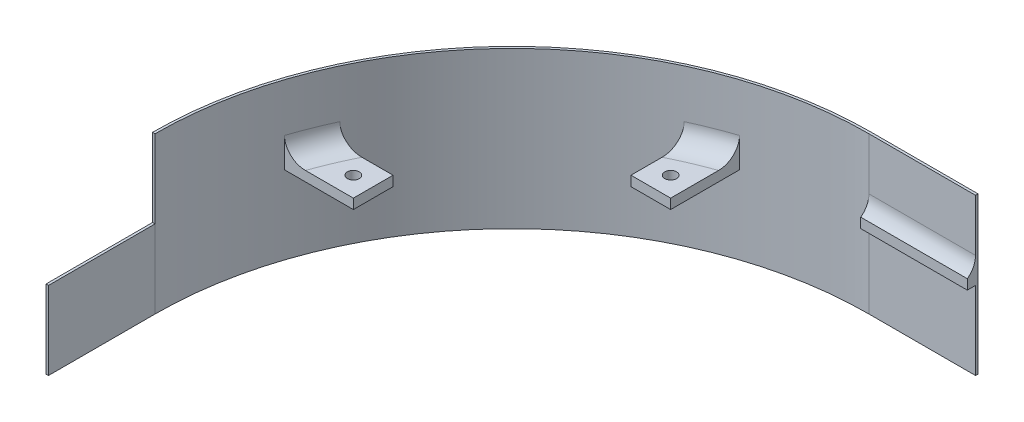
ISO-10303-21;
HEADER;
FILE_DESCRIPTION(('STEP AP214'),'2;1');
FILE_NAME('part.step','',(''),(''),'','','');
FILE_SCHEMA(('AUTOMOTIVE_DESIGN { 1 0 10303 214 1 1 1 1 }'));
ENDSEC;
DATA;
#1=APPLICATION_CONTEXT('core data for automotive mechanical design processes');
#2=APPLICATION_PROTOCOL_DEFINITION('international standard','automotive_design',2000,#1);
#3=PRODUCT_CONTEXT('',#1,'mechanical');
#4=PRODUCT('Part','Part','',(#3));
#5=PRODUCT_RELATED_PRODUCT_CATEGORY('part','',(#4));
#6=PRODUCT_DEFINITION_FORMATION('','',#4);
#7=PRODUCT_DEFINITION_CONTEXT('part definition',#1,'design');
#8=PRODUCT_DEFINITION('design','',#6,#7);
#9=PRODUCT_DEFINITION_SHAPE('','',#8);
#10=(LENGTH_UNIT() NAMED_UNIT(*) SI_UNIT(.MILLI.,.METRE.));
#11=(NAMED_UNIT(*) PLANE_ANGLE_UNIT() SI_UNIT($,.RADIAN.));
#12=(NAMED_UNIT(*) SI_UNIT($,.STERADIAN.) SOLID_ANGLE_UNIT());
#13=UNCERTAINTY_MEASURE_WITH_UNIT(LENGTH_MEASURE(1.E-05),#10,'distance_accuracy_value','');
#14=(GEOMETRIC_REPRESENTATION_CONTEXT(3) GLOBAL_UNCERTAINTY_ASSIGNED_CONTEXT((#13)) GLOBAL_UNIT_ASSIGNED_CONTEXT((#10,
#11,#12)) REPRESENTATION_CONTEXT('',''));
#15=CARTESIAN_POINT('',(0.,0.,0.));
#16=DIRECTION('',(0.,0.,1.));
#17=DIRECTION('',(1.,0.,0.));
#18=AXIS2_PLACEMENT_3D('',#15,#16,#17);
#19=CARTESIAN_POINT('',(-34.1312500000015,9.525,-3.60645655631519E-13));
#20=DIRECTION('',(1.,0.,0.));
#21=DIRECTION('',(0.,0.,-1.));
#22=AXIS2_PLACEMENT_3D('',#19,#20,#21);
#23=PLANE('',#22);
#24=DIRECTION('',(0.,-1.,0.));
#25=VECTOR('',#24,1.);
#26=CARTESIAN_POINT('',(-34.13125,31.35,-148.43125));
#27=LINE('',#26,#25);
#28=CARTESIAN_POINT('',(-34.13125,14.6689327311382,-148.43125));
#29=VERTEX_POINT('',#28);
#30=CARTESIAN_POINT('',(-34.13125,6.35,-148.43125));
#31=VERTEX_POINT('',#30);
#32=EDGE_CURVE('E58',#29,#31,#27,.T.);
#33=ORIENTED_EDGE('',*,*,#32,.T.);
#34=DIRECTION('',(0.,0.,1.));
#35=VECTOR('',#34,1.);
#36=CARTESIAN_POINT('',(-34.1312500000015,6.35,-3.60645655631519E-13));
#37=LINE('',#36,#35);
#38=CARTESIAN_POINT('',(-34.13125,6.35,-145.804481937115));
#39=VERTEX_POINT('',#38);
#40=EDGE_CURVE('E315',#31,#39,#37,.T.);
#41=ORIENTED_EDGE('',*,*,#40,.T.);
#42=DIRECTION('',(0.,-1.,0.));
#43=VECTOR('',#42,1.);
#44=CARTESIAN_POINT('',(-34.13125,9.525,-145.804481937115));
#45=LINE('',#44,#43);
#46=CARTESIAN_POINT('',(-34.13125,9.525,-145.804481937115));
#47=VERTEX_POINT('',#46);
#48=EDGE_CURVE('E306',#47,#39,#45,.T.);
#49=ORIENTED_EDGE('',*,*,#48,.F.);
#50=CARTESIAN_POINT('',(-34.13125,14.6689327311382,-142.081250000004));
#51=DIRECTION('',(1.,0.,0.));
#52=DIRECTION('',(0.,0.,-1.));
#53=AXIS2_PLACEMENT_3D('',#50,#51,#52);
#54=CIRCLE('',#53,6.35);
#55=EDGE_CURVE('E51',#47,#29,#54,.T.);
#56=ORIENTED_EDGE('',*,*,#55,.T.);
#57=EDGE_LOOP('',(#33,#41,#49,#56));
#58=FACE_BOUND('',#57,.T.);
#59=ADVANCED_FACE('F42',(#58),#23,.F.);
#60=CARTESIAN_POINT('',(0.,9.525,0.));
#61=DIRECTION('',(1.,0.,0.));
#62=DIRECTION('',(0.,0.,-1.));
#63=AXIS2_PLACEMENT_3D('',#60,#61,#62);
#64=PLANE('',#63);
#65=DIRECTION('',(0.,-1.,0.));
#66=VECTOR('',#65,1.);
#67=CARTESIAN_POINT('',(0.,6.35,-149.225));
#68=LINE('',#67,#66);
#69=CARTESIAN_POINT('',(0.,31.35,-149.225));
#70=VERTEX_POINT('',#69);
#71=CARTESIAN_POINT('',(0.,-18.65,-149.225));
#72=VERTEX_POINT('',#71);
#73=EDGE_CURVE('E299',#70,#72,#68,.T.);
#74=ORIENTED_EDGE('',*,*,#73,.F.);
#75=DIRECTION('',(0.,0.,-1.));
#76=VECTOR('',#75,1.);
#77=CARTESIAN_POINT('',(0.,31.35,0.));
#78=LINE('',#77,#76);
#79=CARTESIAN_POINT('',(0.,31.35,-148.43125));
#80=VERTEX_POINT('',#79);
#81=EDGE_CURVE('E468',#80,#70,#78,.T.);
#82=ORIENTED_EDGE('',*,*,#81,.F.);
#83=DIRECTION('',(0.,-1.,0.));
#84=VECTOR('',#83,1.);
#85=CARTESIAN_POINT('',(0.,31.35,-148.43125));
#86=LINE('',#85,#84);
#87=CARTESIAN_POINT('',(0.,14.6689327311382,-148.43125));
#88=VERTEX_POINT('',#87);
#89=EDGE_CURVE('E242',#80,#88,#86,.T.);
#90=ORIENTED_EDGE('',*,*,#89,.T.);
#91=CARTESIAN_POINT('',(1.50129238041953E-12,14.6689327311382,-142.08125));
#92=DIRECTION('',(1.,0.,0.));
#93=DIRECTION('',(0.,0.,-1.));
#94=AXIS2_PLACEMENT_3D('',#91,#92,#93);
#95=CIRCLE('',#94,6.35);
#96=CARTESIAN_POINT('',(0.,9.525,-145.804481937115));
#97=VERTEX_POINT('',#96);
#98=EDGE_CURVE('E11',#88,#97,#95,.F.);
#99=ORIENTED_EDGE('',*,*,#98,.T.);
#100=DIRECTION('',(0.,-1.,0.));
#101=VECTOR('',#100,1.);
#102=CARTESIAN_POINT('',(0.,9.525,-145.804481937115));
#103=LINE('',#102,#101);
#104=CARTESIAN_POINT('',(0.,6.35,-145.804481937111));
#105=VERTEX_POINT('',#104);
#106=EDGE_CURVE('E311',#97,#105,#103,.T.);
#107=ORIENTED_EDGE('',*,*,#106,.T.);
#108=DIRECTION('',(0.,0.,1.));
#109=VECTOR('',#108,1.);
#110=CARTESIAN_POINT('',(0.,6.35,0.));
#111=LINE('',#110,#109);
#112=CARTESIAN_POINT('',(0.,6.35,-148.43125));
#113=VERTEX_POINT('',#112);
#114=EDGE_CURVE('E318',#113,#105,#111,.T.);
#115=ORIENTED_EDGE('',*,*,#114,.F.);
#116=CARTESIAN_POINT('',(0.,-18.65,-148.43125));
#117=VERTEX_POINT('',#116);
#118=EDGE_CURVE('E221',#113,#117,#86,.T.);
#119=ORIENTED_EDGE('',*,*,#118,.T.);
#120=DIRECTION('',(0.,0.,-1.));
#121=VECTOR('',#120,1.);
#122=CARTESIAN_POINT('',(0.,-18.65,0.));
#123=LINE('',#122,#121);
#124=EDGE_CURVE('E438',#117,#72,#123,.T.);
#125=ORIENTED_EDGE('',*,*,#124,.T.);
#126=EDGE_LOOP('',(#74,#82,#90,#99,#107,#115,#119,#125));
#127=FACE_BOUND('',#126,.T.);
#128=ADVANCED_FACE('F396',(#127),#64,.T.);
#129=CARTESIAN_POINT('',(1.51317146678338E-11,0.,-145.804481937111));
#130=DIRECTION('',(-1.03780860963934E-13,0.,1.));
#131=DIRECTION('',(1.,0.,1.03780860963934E-13));
#132=AXIS2_PLACEMENT_3D('',#129,#130,#131);
#133=PLANE('',#132);
#134=DIRECTION('',(-1.,0.,-1.03780860963934E-13));
#135=VECTOR('',#134,1.);
#136=CARTESIAN_POINT('',(1.51317146678338E-11,6.35,-145.804481937111));
#137=LINE('',#136,#135);
#138=EDGE_CURVE('E310',#105,#39,#137,.T.);
#139=ORIENTED_EDGE('',*,*,#138,.F.);
#140=ORIENTED_EDGE('',*,*,#106,.F.);
#141=DIRECTION('',(1.,0.,0.));
#142=VECTOR('',#141,1.);
#143=CARTESIAN_POINT('',(0.,9.525,-145.804481937115));
#144=LINE('',#143,#142);
#145=EDGE_CURVE('E305',#47,#97,#144,.T.);
#146=ORIENTED_EDGE('',*,*,#145,.F.);
#147=ORIENTED_EDGE('',*,*,#48,.T.);
#148=EDGE_LOOP('',(#139,#140,#146,#147));
#149=FACE_BOUND('',#148,.T.);
#150=ADVANCED_FACE('F393',(#149),#133,.T.);
#151=CARTESIAN_POINT('',(-34.13125,6.35,34.13125));
#152=DIRECTION('',(0.,1.,0.));
#153=DIRECTION('',(0.,0.,1.));
#154=AXIS2_PLACEMENT_3D('',#151,#152,#153);
#155=PLANE('',#154);
#156=DIRECTION('',(-1.,0.,0.));
#157=VECTOR('',#156,1.);
#158=CARTESIAN_POINT('',(-34.1312499999998,6.35,-148.43125));
#159=LINE('',#158,#157);
#160=EDGE_CURVE('E321',#113,#31,#159,.T.);
#161=ORIENTED_EDGE('',*,*,#160,.F.);
#162=ORIENTED_EDGE('',*,*,#114,.T.);
#163=ORIENTED_EDGE('',*,*,#138,.T.);
#164=ORIENTED_EDGE('',*,*,#40,.F.);
#165=EDGE_LOOP('',(#161,#162,#163,#164));
#166=FACE_BOUND('',#165,.T.);
#167=ADVANCED_FACE('F391',(#166),#155,.F.);
#168=CARTESIAN_POINT('',(0.,31.35,-149.225));
#169=DIRECTION('',(0.,0.,1.));
#170=DIRECTION('',(1.,0.,0.));
#171=AXIS2_PLACEMENT_3D('',#168,#169,#170);
#172=PLANE('',#171);
#173=DIRECTION('',(0.,1.,0.));
#174=VECTOR('',#173,1.);
#175=CARTESIAN_POINT('',(-34.13125,9.525,-149.225));
#176=LINE('',#175,#174);
#177=CARTESIAN_POINT('',(-34.13125,-18.65,-149.225));
#178=VERTEX_POINT('',#177);
#179=CARTESIAN_POINT('',(-34.13125,31.35,-149.225));
#180=VERTEX_POINT('',#179);
#181=EDGE_CURVE('E302',#178,#180,#176,.T.);
#182=ORIENTED_EDGE('',*,*,#181,.T.);
#183=DIRECTION('',(-1.,0.,0.));
#184=VECTOR('',#183,1.);
#185=CARTESIAN_POINT('',(0.,31.35,-149.225));
#186=LINE('',#185,#184);
#187=EDGE_CURVE('E472',#70,#180,#186,.T.);
#188=ORIENTED_EDGE('',*,*,#187,.F.);
#189=ORIENTED_EDGE('',*,*,#73,.T.);
#190=DIRECTION('',(-1.,0.,0.));
#191=VECTOR('',#190,1.);
#192=CARTESIAN_POINT('',(0.,-18.65,-149.225));
#193=LINE('',#192,#191);
#194=EDGE_CURVE('E442',#72,#178,#193,.T.);
#195=ORIENTED_EDGE('',*,*,#194,.T.);
#196=EDGE_LOOP('',(#182,#188,#189,#195));
#197=FACE_BOUND('',#196,.T.);
#198=ADVANCED_FACE('F387',(#197),#172,.F.);
#199=CARTESIAN_POINT('',(1.20704480002851E-13,31.35,-148.43125));
#200=DIRECTION('',(0.,0.,-1.));
#201=DIRECTION('',(-1.,0.,0.));
#202=AXIS2_PLACEMENT_3D('',#199,#200,#201);
#203=PLANE('',#202);
#204=ORIENTED_EDGE('',*,*,#118,.F.);
#205=ORIENTED_EDGE('',*,*,#160,.T.);
#206=CARTESIAN_POINT('',(-34.13125,-18.65,-148.43125));
#207=VERTEX_POINT('',#206);
#208=EDGE_CURVE('E245',#31,#207,#27,.T.);
#209=ORIENTED_EDGE('',*,*,#208,.T.);
#210=DIRECTION('',(1.,0.,0.));
#211=VECTOR('',#210,1.);
#212=CARTESIAN_POINT('',(1.20704480002851E-13,-18.65,-148.43125));
#213=LINE('',#212,#211);
#214=EDGE_CURVE('E426',#207,#117,#213,.T.);
#215=ORIENTED_EDGE('',*,*,#214,.T.);
#216=EDGE_LOOP('',(#204,#205,#209,#215));
#217=FACE_BOUND('',#216,.T.);
#218=ADVANCED_FACE('F390',(#217),#203,.F.);
#219=CARTESIAN_POINT('',(-76.2,6.35,-127.));
#220=DIRECTION('',(0.,1.,0.));
#221=DIRECTION('',(0.,0.,1.));
#222=AXIS2_PLACEMENT_3D('',#219,#220,#221);
#223=CYLINDRICAL_SURFACE('',#222,1.89865);
#224=CARTESIAN_POINT('',(-76.2,6.35,-127.));
#225=DIRECTION('',(0.,1.,0.));
#226=DIRECTION('',(0.,0.,1.));
#227=AXIS2_PLACEMENT_3D('',#224,#225,#226);
#228=CIRCLE('',#227,1.89865);
#229=CARTESIAN_POINT('',(-76.2,6.35,-125.10135));
#230=VERTEX_POINT('',#229);
#231=EDGE_CURVE('E290',#230,#230,#228,.F.);
#232=ORIENTED_EDGE('',*,*,#231,.T.);
#233=EDGE_LOOP('',(#232));
#234=FACE_BOUND('',#233,.T.);
#235=CARTESIAN_POINT('',(-76.2,9.525,-127.));
#236=DIRECTION('',(0.,1.,0.));
#237=DIRECTION('',(0.,0.,1.));
#238=AXIS2_PLACEMENT_3D('',#235,#236,#237);
#239=CIRCLE('',#238,1.89865000000001);
#240=CARTESIAN_POINT('',(-76.2,9.525,-125.10135));
#241=VERTEX_POINT('',#240);
#242=EDGE_CURVE('E286',#241,#241,#239,.T.);
#243=ORIENTED_EDGE('',*,*,#242,.T.);
#244=EDGE_LOOP('',(#243));
#245=FACE_BOUND('',#244,.T.);
#246=ADVANCED_FACE('F606',(#234,#245),#223,.F.);
#247=CARTESIAN_POINT('',(-69.85,9.525,0.));
#248=DIRECTION('',(1.,0.,0.));
#249=DIRECTION('',(0.,0.,-1.));
#250=AXIS2_PLACEMENT_3D('',#247,#248,#249);
#251=PLANE('',#250);
#252=DIRECTION('',(0.,0.,1.));
#253=VECTOR('',#252,1.);
#254=CARTESIAN_POINT('',(-69.85,6.35,0.));
#255=LINE('',#254,#253);
#256=CARTESIAN_POINT('',(-69.85,6.35,-142.70684992207));
#257=VERTEX_POINT('',#256);
#258=CARTESIAN_POINT('',(-69.85,6.35,-120.65));
#259=VERTEX_POINT('',#258);
#260=EDGE_CURVE('E263',#257,#259,#255,.T.);
#261=ORIENTED_EDGE('',*,*,#260,.F.);
#262=DIRECTION('',(0.,-1.,0.));
#263=VECTOR('',#262,1.);
#264=CARTESIAN_POINT('',(-69.85,9.525,-142.70684992207));
#265=LINE('',#264,#263);
#266=CARTESIAN_POINT('',(-69.85,15.875,-142.70684992207));
#267=VERTEX_POINT('',#266);
#268=EDGE_CURVE('E249',#267,#257,#265,.T.);
#269=ORIENTED_EDGE('',*,*,#268,.F.);
#270=CARTESIAN_POINT('',(-69.85,15.875,-142.70684992207));
#271=CARTESIAN_POINT('',(-69.85,15.7029730837197,-142.706874301117));
#272=CARTESIAN_POINT('',(-69.85,15.5309520105291,-142.69949190502));
#273=CARTESIAN_POINT('',(-69.85,15.1881891450099,-142.670091536003));
#274=CARTESIAN_POINT('',(-69.85,15.0174471718281,-142.648075673186));
#275=CARTESIAN_POINT('',(-69.85,14.6788113950012,-142.589646917109));
#276=CARTESIAN_POINT('',(-69.85,14.5109124176667,-142.553263984953));
#277=CARTESIAN_POINT('',(-69.85,14.1787911202401,-142.466439599448));
#278=CARTESIAN_POINT('',(-69.85,14.0145688227889,-142.415998059552));
#279=CARTESIAN_POINT('',(-69.85,13.6909743994701,-142.301517535391));
#280=CARTESIAN_POINT('',(-69.85,13.5316013083891,-142.237481277608));
#281=CARTESIAN_POINT('',(-69.85,13.2186846904439,-142.09633886843));
#282=CARTESIAN_POINT('',(-69.85,13.0651433406247,-142.01922789369));
#283=CARTESIAN_POINT('',(-69.85,12.7649784160801,-141.852623552127));
#284=CARTESIAN_POINT('',(-69.85,12.6183534171835,-141.763132749538));
#285=CARTESIAN_POINT('',(-69.85,12.3328430648346,-141.572454856799));
#286=CARTESIAN_POINT('',(-69.85,12.1939606503898,-141.471263369393));
#287=CARTESIAN_POINT('',(-69.85,11.922124523184,-141.255878094146));
#288=CARTESIAN_POINT('',(-69.85,11.7893446242397,-141.141464981251));
#289=CARTESIAN_POINT('',(-69.85,11.5334778569693,-140.902188660024));
#290=CARTESIAN_POINT('',(-69.85,11.4103945461821,-140.777321650645));
#291=CARTESIAN_POINT('',(-69.85,11.1746694170668,-140.518139609766));
#292=CARTESIAN_POINT('',(-69.85,11.0620257122504,-140.383826293006));
#293=CARTESIAN_POINT('',(-69.85,10.8476952655946,-140.106652967732));
#294=CARTESIAN_POINT('',(-69.85,10.7460126219476,-139.963789793376));
#295=CARTESIAN_POINT('',(-69.85,10.5495991021917,-139.663604728547));
#296=CARTESIAN_POINT('',(-69.85,10.4554246688917,-139.505918559722));
#297=CARTESIAN_POINT('',(-69.85,10.2801154199647,-139.183388396162));
#298=CARTESIAN_POINT('',(-69.85,10.1989856951893,-139.018541638647));
#299=CARTESIAN_POINT('',(-69.85,10.0501911580244,-138.682907173367));
#300=CARTESIAN_POINT('',(-69.85,9.98252396358919,-138.512120522893));
#301=CARTESIAN_POINT('',(-69.85,9.86091141448976,-138.165719100756));
#302=CARTESIAN_POINT('',(-69.85,9.80697008112843,-137.990102930834));
#303=CARTESIAN_POINT('',(-69.85,9.6818434422385,-137.517188487166));
#304=CARTESIAN_POINT('',(-69.85,9.62297810563583,-137.216496027471));
#305=CARTESIAN_POINT('',(-69.85,9.56417179388388,-136.762166190584));
#306=CARTESIAN_POINT('',(-69.85,9.54948495745367,-136.610257552565));
#307=CARTESIAN_POINT('',(-69.85,9.52990146398584,-136.305799133927));
#308=CARTESIAN_POINT('',(-69.85,9.52500550732103,-136.153249308224));
#309=CARTESIAN_POINT('',(-69.85,9.525,-136.000643825808));
#310=B_SPLINE_CURVE_WITH_KNOTS('',3,(#270,#271,#272,#273,#274,#275,#276,#277,#278,#279,#280,
#281,#282,#283,#284,#285,#286,#287,#288,#289,#290,#291,#292,#293,#294,#295,#296,#297,#298,#299,
#300,#301,#302,#303,#304,#305,#306,#307,#308,#309),.UNSPECIFIED.,.F.,.F.,(4,2,2,2,2,2,2,2,2,2,2,
2,2,2,2,2,2,2,2,4),(0.,0.515913593789876,1.03175281055767,1.54652192893622,2.06129421637289,
2.57596336127693,3.09082278562198,3.60557572639802,4.12052275011045,4.64575466642888,
5.17117839396484,5.69650698894978,6.22203132087301,6.77241709664297,7.32301714833505,
7.8735196906273,8.42418332993365,9.34036051937623,9.79795370220859,10.2555796169682),.UNSPECIFIED.);
#311=CARTESIAN_POINT('',(-69.85,9.525,-136.000643825808));
#312=VERTEX_POINT('',#311);
#313=EDGE_CURVE('E356',#267,#312,#310,.T.);
#314=ORIENTED_EDGE('',*,*,#313,.T.);
#315=DIRECTION('',(0.,0.,1.));
#316=VECTOR('',#315,1.);
#317=CARTESIAN_POINT('',(-69.85,9.525,0.));
#318=LINE('',#317,#316);
#319=CARTESIAN_POINT('',(-69.85,9.525,-120.65));
#320=VERTEX_POINT('',#319);
#321=EDGE_CURVE('E268',#312,#320,#318,.T.);
#322=ORIENTED_EDGE('',*,*,#321,.T.);
#323=DIRECTION('',(0.,-1.,0.));
#324=VECTOR('',#323,1.);
#325=CARTESIAN_POINT('',(-69.85,9.525,-120.65));
#326=LINE('',#325,#324);
#327=EDGE_CURVE('E264',#320,#259,#326,.T.);
#328=ORIENTED_EDGE('',*,*,#327,.T.);
#329=EDGE_LOOP('',(#261,#269,#314,#322,#328));
#330=FACE_BOUND('',#329,.T.);
#331=ADVANCED_FACE('F371',(#330),#251,.T.);
#332=CARTESIAN_POINT('',(-82.5499999999999,9.525,0.));
#333=DIRECTION('',(-1.,0.,0.));
#334=DIRECTION('',(0.,0.,1.));
#335=AXIS2_PLACEMENT_3D('',#332,#333,#334);
#336=PLANE('',#335);
#337=DIRECTION('',(0.,0.,-1.));
#338=VECTOR('',#337,1.);
#339=CARTESIAN_POINT('',(-82.5499999999999,6.35,0.));
#340=LINE('',#339,#338);
#341=CARTESIAN_POINT('',(-82.55,6.35,-120.65));
#342=VERTEX_POINT('',#341);
#343=CARTESIAN_POINT('',(-82.55,6.35,-137.669236499823));
#344=VERTEX_POINT('',#343);
#345=EDGE_CURVE('E272',#342,#344,#340,.T.);
#346=ORIENTED_EDGE('',*,*,#345,.F.);
#347=DIRECTION('',(0.,-1.,0.));
#348=VECTOR('',#347,1.);
#349=CARTESIAN_POINT('',(-82.55,9.525,-120.65));
#350=LINE('',#349,#348);
#351=CARTESIAN_POINT('',(-82.55,9.525,-120.65));
#352=VERTEX_POINT('',#351);
#353=EDGE_CURVE('E259',#352,#342,#350,.T.);
#354=ORIENTED_EDGE('',*,*,#353,.F.);
#355=DIRECTION('',(0.,0.,-1.));
#356=VECTOR('',#355,1.);
#357=CARTESIAN_POINT('',(-82.5499999999999,9.525,0.));
#358=LINE('',#357,#356);
#359=CARTESIAN_POINT('',(-82.55,9.525,-130.613513387824));
#360=VERTEX_POINT('',#359);
#361=EDGE_CURVE('E258',#352,#360,#358,.T.);
#362=ORIENTED_EDGE('',*,*,#361,.T.);
#363=CARTESIAN_POINT('',(-82.55,9.525,-130.613513387824));
#364=CARTESIAN_POINT('',(-82.55,9.52499314005643,-130.830042423572));
#365=CARTESIAN_POINT('',(-82.55,9.53384705249825,-131.046583334911));
#366=CARTESIAN_POINT('',(-82.55,9.56930694414717,-131.478258900228));
#367=CARTESIAN_POINT('',(-82.55,9.59591733347143,-131.693393191441));
#368=CARTESIAN_POINT('',(-82.55,9.66703938801873,-132.121430553156));
#369=CARTESIAN_POINT('',(-82.55,9.71161058708535,-132.33432376306));
#370=CARTESIAN_POINT('',(-82.55,9.81861323997792,-132.755565053247));
#371=CARTESIAN_POINT('',(-82.55,9.88104334357952,-132.963913475859));
#372=CARTESIAN_POINT('',(-82.55,10.0238120409826,-133.37489756143));
#373=CARTESIAN_POINT('',(-82.55,10.1041889144697,-133.577519954505));
#374=CARTESIAN_POINT('',(-82.55,10.282563430062,-133.974857311888));
#375=CARTESIAN_POINT('',(-82.55,10.3805601310296,-134.169572697856));
#376=CARTESIAN_POINT('',(-82.55,10.5937060130399,-134.549070064569));
#377=CARTESIAN_POINT('',(-82.55,10.708833311701,-134.733864314499));
#378=CARTESIAN_POINT('',(-82.55,10.9558287662296,-135.091908385238));
#379=CARTESIAN_POINT('',(-82.55,11.0876953329953,-135.265159299508));
#380=CARTESIAN_POINT('',(-82.55,11.3578462298925,-135.586748114352));
#381=CARTESIAN_POINT('',(-82.55,11.4950666448277,-135.735979877396));
#382=CARTESIAN_POINT('',(-82.55,11.7826522899758,-136.021181743505));
#383=CARTESIAN_POINT('',(-82.55,11.9330158469817,-136.157153530002));
#384=CARTESIAN_POINT('',(-82.55,12.2459426857868,-136.414283733556));
#385=CARTESIAN_POINT('',(-82.55,12.4085064652591,-136.535441545789));
#386=CARTESIAN_POINT('',(-82.55,12.7446242977029,-136.761399933134));
#387=CARTESIAN_POINT('',(-82.55,12.9181767219637,-136.866202924377));
#388=CARTESIAN_POINT('',(-82.55,13.2562285056879,-137.048029134856));
#389=CARTESIAN_POINT('',(-82.55,13.4197846121103,-137.126809576852));
#390=CARTESIAN_POINT('',(-82.55,13.7533643108135,-137.269195872368));
#391=CARTESIAN_POINT('',(-82.55,13.9233870021112,-137.332803830939));
#392=CARTESIAN_POINT('',(-82.55,14.2682626257401,-137.443972242396));
#393=CARTESIAN_POINT('',(-82.55,14.4431063175079,-137.491561360913));
#394=CARTESIAN_POINT('',(-82.55,14.7963907046569,-137.57022217493));
#395=CARTESIAN_POINT('',(-82.55,14.9748292761608,-137.601303342646));
#396=CARTESIAN_POINT('',(-82.55,15.2738862662166,-137.639021752341));
#397=CARTESIAN_POINT('',(-82.55,15.3939320286214,-137.650354691676));
#398=CARTESIAN_POINT('',(-82.55,15.6343133194141,-137.6654589635));
#399=CARTESIAN_POINT('',(-82.55,15.7546481216502,-137.669241859266));
#400=CARTESIAN_POINT('',(-82.55,15.875,-137.669236499823));
#401=B_SPLINE_CURVE_WITH_KNOTS('',3,(#363,#364,#365,#366,#367,#368,#369,#370,#371,#372,#373,
#374,#375,#376,#377,#378,#379,#380,#381,#382,#383,#384,#385,#386,#387,#388,#389,#390,#391,#392,
#393,#394,#395,#396,#397,#398,#399,#400),.UNSPECIFIED.,.F.,.F.,(4,2,2,2,2,2,2,2,2,2,2,2,2,2,2,2,
2,2,4),(0.,0.6494248745263,1.29901110461665,1.95076843477889,2.60247650177724,3.25558814310972,
3.90866490978784,4.56091449556762,5.21310220785519,5.82046746798391,6.42775551888954,
7.03506835584355,7.64229138809814,8.18619225586145,8.73001761807555,9.27286456869496,
9.81539969783369,10.1769166173106,10.5378794290146),.UNSPECIFIED.);
#402=CARTESIAN_POINT('',(-82.55,15.875,-137.669236499823));
#403=VERTEX_POINT('',#402);
#404=EDGE_CURVE('E346',#360,#403,#401,.T.);
#405=ORIENTED_EDGE('',*,*,#404,.T.);
#406=DIRECTION('',(0.,-1.,0.));
#407=VECTOR('',#406,1.);
#408=CARTESIAN_POINT('',(-82.55,9.525,-137.669236499823));
#409=LINE('',#408,#407);
#410=EDGE_CURVE('E254',#403,#344,#409,.T.);
#411=ORIENTED_EDGE('',*,*,#410,.T.);
#412=EDGE_LOOP('',(#346,#354,#362,#405,#411));
#413=FACE_BOUND('',#412,.T.);
#414=ADVANCED_FACE('F366',(#413),#336,.T.);
#415=CARTESIAN_POINT('',(0.,9.525,-120.65));
#416=DIRECTION('',(0.,0.,1.));
#417=DIRECTION('',(1.,0.,0.));
#418=AXIS2_PLACEMENT_3D('',#415,#416,#417);
#419=PLANE('',#418);
#420=DIRECTION('',(-1.,0.,0.));
#421=VECTOR('',#420,1.);
#422=CARTESIAN_POINT('',(0.,6.35,-120.65));
#423=LINE('',#422,#421);
#424=EDGE_CURVE('E269',#259,#342,#423,.T.);
#425=ORIENTED_EDGE('',*,*,#424,.F.);
#426=ORIENTED_EDGE('',*,*,#327,.F.);
#427=DIRECTION('',(-1.,0.,0.));
#428=VECTOR('',#427,1.);
#429=CARTESIAN_POINT('',(0.,9.525,-120.65));
#430=LINE('',#429,#428);
#431=EDGE_CURVE('E257',#320,#352,#430,.T.);
#432=ORIENTED_EDGE('',*,*,#431,.T.);
#433=ORIENTED_EDGE('',*,*,#353,.T.);
#434=EDGE_LOOP('',(#425,#426,#432,#433));
#435=FACE_BOUND('',#434,.T.);
#436=ADVANCED_FACE('F370',(#435),#419,.T.);
#437=CARTESIAN_POINT('',(0.,9.525,0.));
#438=DIRECTION('',(0.,1.,0.));
#439=DIRECTION('',(0.,0.,1.));
#440=AXIS2_PLACEMENT_3D('',#437,#438,#439);
#441=PLANE('',#440);
#442=ORIENTED_EDGE('',*,*,#242,.F.);
#443=EDGE_LOOP('',(#442));
#444=FACE_BOUND('',#443,.T.);
#445=ORIENTED_EDGE('',*,*,#321,.F.);
#446=CARTESIAN_POINT('',(-34.13125,9.525,-34.13125));
#447=DIRECTION('',(0.,1.,0.));
#448=DIRECTION('',(0.,0.,1.));
#449=AXIS2_PLACEMENT_3D('',#446,#447,#448);
#450=CIRCLE('',#449,107.95);
#451=EDGE_CURVE('E330',#312,#360,#450,.T.);
#452=ORIENTED_EDGE('',*,*,#451,.T.);
#453=ORIENTED_EDGE('',*,*,#361,.F.);
#454=ORIENTED_EDGE('',*,*,#431,.F.);
#455=EDGE_LOOP('',(#445,#452,#453,#454));
#456=FACE_BOUND('',#455,.T.);
#457=ADVANCED_FACE('F377',(#444,#456),#441,.T.);
#458=CARTESIAN_POINT('',(-34.13125,6.35,34.13125));
#459=DIRECTION('',(0.,1.,0.));
#460=DIRECTION('',(0.,0.,1.));
#461=AXIS2_PLACEMENT_3D('',#458,#459,#460);
#462=PLANE('',#461);
#463=ORIENTED_EDGE('',*,*,#260,.T.);
#464=ORIENTED_EDGE('',*,*,#424,.T.);
#465=ORIENTED_EDGE('',*,*,#345,.T.);
#466=CARTESIAN_POINT('',(-34.13125,6.35,-34.13125));
#467=DIRECTION('',(0.,1.,0.));
#468=DIRECTION('',(0.,0.,1.));
#469=AXIS2_PLACEMENT_3D('',#466,#467,#468);
#470=CIRCLE('',#469,114.3);
#471=EDGE_CURVE('E253',#257,#344,#470,.T.);
#472=ORIENTED_EDGE('',*,*,#471,.F.);
#473=EDGE_LOOP('',(#463,#464,#465,#472));
#474=FACE_BOUND('',#473,.T.);
#475=ORIENTED_EDGE('',*,*,#231,.F.);
#476=EDGE_LOOP('',(#475));
#477=FACE_BOUND('',#476,.T.);
#478=ADVANCED_FACE('F381',(#474,#477),#462,.F.);
#479=CARTESIAN_POINT('',(-34.13125,31.35,-34.13125));
#480=DIRECTION('',(0.,-1.,0.));
#481=DIRECTION('',(0.,0.,-1.));
#482=AXIS2_PLACEMENT_3D('',#479,#480,#481);
#483=CYLINDRICAL_SURFACE('',#482,114.3);
#484=DIRECTION('',(0.,-1.,0.));
#485=VECTOR('',#484,1.);
#486=CARTESIAN_POINT('',(-142.70684992207,9.525,-69.8499999999999));
#487=LINE('',#486,#485);
#488=CARTESIAN_POINT('',(-142.70684992207,15.875,-69.8499999999999));
#489=VERTEX_POINT('',#488);
#490=CARTESIAN_POINT('',(-142.70684992207,6.35,-69.8499999999999));
#491=VERTEX_POINT('',#490);
#492=EDGE_CURVE('E535',#489,#491,#487,.T.);
#493=ORIENTED_EDGE('',*,*,#492,.F.);
#494=CARTESIAN_POINT('',(-34.13125,15.875,-34.13125));
#495=DIRECTION('',(0.,1.,0.));
#496=DIRECTION('',(0.,0.,1.));
#497=AXIS2_PLACEMENT_3D('',#494,#495,#496);
#498=CIRCLE('',#497,114.3);
#499=CARTESIAN_POINT('',(-137.669236499823,15.875,-82.5499999999999));
#500=VERTEX_POINT('',#499);
#501=EDGE_CURVE('E334',#489,#500,#498,.F.);
#502=ORIENTED_EDGE('',*,*,#501,.T.);
#503=DIRECTION('',(0.,-1.,0.));
#504=VECTOR('',#503,1.);
#505=CARTESIAN_POINT('',(-137.669236499823,9.525,-82.5499999999999));
#506=LINE('',#505,#504);
#507=CARTESIAN_POINT('',(-137.669236499823,6.35,-82.5499999999999));
#508=VERTEX_POINT('',#507);
#509=EDGE_CURVE('E434',#500,#508,#506,.T.);
#510=ORIENTED_EDGE('',*,*,#509,.T.);
#511=CARTESIAN_POINT('',(-34.13125,6.35,-34.13125));
#512=DIRECTION('',(0.,1.,0.));
#513=DIRECTION('',(0.,0.,1.));
#514=AXIS2_PLACEMENT_3D('',#511,#512,#513);
#515=CIRCLE('',#514,114.3);
#516=EDGE_CURVE('E490',#508,#491,#515,.T.);
#517=ORIENTED_EDGE('',*,*,#516,.T.);
#518=EDGE_LOOP('',(#493,#502,#510,#517));
#519=FACE_BOUND('',#518,.T.);
#520=ORIENTED_EDGE('',*,*,#410,.F.);
#521=CARTESIAN_POINT('',(-34.13125,15.875,-34.13125));
#522=DIRECTION('',(0.,1.,0.));
#523=DIRECTION('',(0.,0.,1.));
#524=AXIS2_PLACEMENT_3D('',#521,#522,#523);
#525=CIRCLE('',#524,114.3);
#526=EDGE_CURVE('E338',#403,#267,#525,.F.);
#527=ORIENTED_EDGE('',*,*,#526,.T.);
#528=ORIENTED_EDGE('',*,*,#268,.T.);
#529=ORIENTED_EDGE('',*,*,#471,.T.);
#530=EDGE_LOOP('',(#520,#527,#528,#529));
#531=FACE_BOUND('',#530,.T.);
#532=DIRECTION('',(0.,-1.,0.));
#533=VECTOR('',#532,1.);
#534=CARTESIAN_POINT('',(-148.43125,31.35,-34.13125));
#535=LINE('',#534,#533);
#536=CARTESIAN_POINT('',(-148.43125,31.35,-34.13125));
#537=VERTEX_POINT('',#536);
#538=CARTESIAN_POINT('',(-148.43125,6.35,-34.13125));
#539=VERTEX_POINT('',#538);
#540=EDGE_CURVE('E479',#537,#539,#535,.T.);
#541=ORIENTED_EDGE('',*,*,#540,.T.);
#542=CARTESIAN_POINT('',(-148.43125,-18.65,-34.13125));
#543=VERTEX_POINT('',#542);
#544=EDGE_CURVE('E429',#539,#543,#535,.T.);
#545=ORIENTED_EDGE('',*,*,#544,.T.);
#546=CARTESIAN_POINT('',(-34.13125,-18.65,-34.13125));
#547=DIRECTION('',(0.,1.,0.));
#548=DIRECTION('',(0.,0.,1.));
#549=AXIS2_PLACEMENT_3D('',#546,#547,#548);
#550=CIRCLE('',#549,114.3);
#551=EDGE_CURVE('E428',#207,#543,#550,.T.);
#552=ORIENTED_EDGE('',*,*,#551,.F.);
#553=ORIENTED_EDGE('',*,*,#208,.F.);
#554=ORIENTED_EDGE('',*,*,#32,.F.);
#555=CARTESIAN_POINT('',(-34.13125,31.35,-148.43125));
#556=VERTEX_POINT('',#555);
#557=EDGE_CURVE('E246',#556,#29,#27,.T.);
#558=ORIENTED_EDGE('',*,*,#557,.F.);
#559=CARTESIAN_POINT('',(-34.13125,31.35,-34.13125));
#560=DIRECTION('',(0.,1.,0.));
#561=DIRECTION('',(0.,0.,1.));
#562=AXIS2_PLACEMENT_3D('',#559,#560,#561);
#563=CIRCLE('',#562,114.3);
#564=EDGE_CURVE('E461',#556,#537,#563,.T.);
#565=ORIENTED_EDGE('',*,*,#564,.T.);
#566=EDGE_LOOP('',(#541,#545,#552,#553,#554,#558,#565));
#567=FACE_BOUND('',#566,.T.);
#568=ADVANCED_FACE('F385',(#519,#531,#567),#483,.F.);
#569=ORIENTED_EDGE('',*,*,#557,.T.);
#570=DIRECTION('',(1.,0.,0.));
#571=VECTOR('',#570,1.);
#572=CARTESIAN_POINT('',(1.20704480002851E-13,14.6689327311382,-148.43125));
#573=LINE('',#572,#571);
#574=EDGE_CURVE('E65',#29,#88,#573,.T.);
#575=ORIENTED_EDGE('',*,*,#574,.T.);
#576=ORIENTED_EDGE('',*,*,#89,.F.);
#577=DIRECTION('',(1.,0.,0.));
#578=VECTOR('',#577,1.);
#579=CARTESIAN_POINT('',(1.20704480002851E-13,31.35,-148.43125));
#580=LINE('',#579,#578);
#581=EDGE_CURVE('E465',#556,#80,#580,.T.);
#582=ORIENTED_EDGE('',*,*,#581,.F.);
#583=EDGE_LOOP('',(#569,#575,#576,#582));
#584=FACE_BOUND('',#583,.T.);
#585=ADVANCED_FACE('F602',(#584),#203,.F.);
#586=CARTESIAN_POINT('',(-34.13125,31.35,-34.13125));
#587=DIRECTION('',(0.,-1.,0.));
#588=DIRECTION('',(0.,0.,-1.));
#589=AXIS2_PLACEMENT_3D('',#586,#587,#588);
#590=CYLINDRICAL_SURFACE('',#589,115.09375);
#591=CARTESIAN_POINT('',(-34.13125,31.35,-34.13125));
#592=DIRECTION('',(0.,1.,0.));
#593=DIRECTION('',(0.,0.,1.));
#594=AXIS2_PLACEMENT_3D('',#591,#592,#593);
#595=CIRCLE('',#594,115.09375);
#596=CARTESIAN_POINT('',(-149.225,31.35,-34.13125));
#597=VERTEX_POINT('',#596);
#598=EDGE_CURVE('E476',#180,#597,#595,.T.);
#599=ORIENTED_EDGE('',*,*,#598,.F.);
#600=ORIENTED_EDGE('',*,*,#181,.F.);
#601=CARTESIAN_POINT('',(-34.13125,-18.65,-34.13125));
#602=DIRECTION('',(0.,1.,0.));
#603=DIRECTION('',(0.,0.,1.));
#604=AXIS2_PLACEMENT_3D('',#601,#602,#603);
#605=CIRCLE('',#604,115.09375);
#606=CARTESIAN_POINT('',(-149.225,-18.65,-34.13125));
#607=VERTEX_POINT('',#606);
#608=EDGE_CURVE('E235',#178,#607,#605,.T.);
#609=ORIENTED_EDGE('',*,*,#608,.T.);
#610=DIRECTION('',(0.,-1.,0.));
#611=VECTOR('',#610,1.);
#612=CARTESIAN_POINT('',(-149.225,31.35,-34.13125));
#613=LINE('',#612,#611);
#614=CARTESIAN_POINT('',(-149.225,6.35,-34.13125));
#615=VERTEX_POINT('',#614);
#616=EDGE_CURVE('E222',#615,#607,#613,.T.);
#617=ORIENTED_EDGE('',*,*,#616,.F.);
#618=EDGE_CURVE('E213',#597,#615,#613,.T.);
#619=ORIENTED_EDGE('',*,*,#618,.F.);
#620=EDGE_LOOP('',(#599,#600,#609,#617,#619));
#621=FACE_BOUND('',#620,.T.);
#622=ADVANCED_FACE('F233',(#621),#590,.T.);
#623=CARTESIAN_POINT('',(-149.225,31.35,0.));
#624=DIRECTION('',(1.,0.,0.));
#625=DIRECTION('',(0.,0.,-1.));
#626=AXIS2_PLACEMENT_3D('',#623,#624,#625);
#627=PLANE('',#626);
#628=DIRECTION('',(0.,-1.,0.));
#629=VECTOR('',#628,1.);
#630=CARTESIAN_POINT('',(-149.225,31.35,0.));
#631=LINE('',#630,#629);
#632=CARTESIAN_POINT('',(-149.225,6.35,0.));
#633=VERTEX_POINT('',#632);
#634=CARTESIAN_POINT('',(-149.225,-18.65,0.));
#635=VERTEX_POINT('',#634);
#636=EDGE_CURVE('E229',#633,#635,#631,.T.);
#637=ORIENTED_EDGE('',*,*,#636,.F.);
#638=DIRECTION('',(0.,0.,-1.));
#639=VECTOR('',#638,1.);
#640=CARTESIAN_POINT('',(-149.225,6.35,-34.13125));
#641=LINE('',#640,#639);
#642=EDGE_CURVE('E203',#633,#615,#641,.T.);
#643=ORIENTED_EDGE('',*,*,#642,.T.);
#644=ORIENTED_EDGE('',*,*,#616,.T.);
#645=DIRECTION('',(0.,0.,1.));
#646=VECTOR('',#645,1.);
#647=CARTESIAN_POINT('',(-149.225,-18.65,0.));
#648=LINE('',#647,#646);
#649=EDGE_CURVE('E451',#607,#635,#648,.T.);
#650=ORIENTED_EDGE('',*,*,#649,.T.);
#651=EDGE_LOOP('',(#637,#643,#644,#650));
#652=FACE_BOUND('',#651,.T.);
#653=ADVANCED_FACE('F226',(#652),#627,.F.);
#654=CARTESIAN_POINT('',(0.,31.35,0.));
#655=DIRECTION('',(0.,0.,1.));
#656=DIRECTION('',(1.,0.,0.));
#657=AXIS2_PLACEMENT_3D('',#654,#655,#656);
#658=PLANE('',#657);
#659=DIRECTION('',(1.,0.,0.));
#660=VECTOR('',#659,1.);
#661=CARTESIAN_POINT('',(0.,6.35,0.));
#662=LINE('',#661,#660);
#663=CARTESIAN_POINT('',(-148.43125,6.35,0.));
#664=VERTEX_POINT('',#663);
#665=EDGE_CURVE('E488',#633,#664,#662,.T.);
#666=ORIENTED_EDGE('',*,*,#665,.F.);
#667=ORIENTED_EDGE('',*,*,#636,.T.);
#668=DIRECTION('',(-1.,0.,0.));
#669=VECTOR('',#668,1.);
#670=CARTESIAN_POINT('',(0.,-18.65,0.));
#671=LINE('',#670,#669);
#672=CARTESIAN_POINT('',(-148.43125,-18.65,0.));
#673=VERTEX_POINT('',#672);
#674=EDGE_CURVE('E454',#673,#635,#671,.T.);
#675=ORIENTED_EDGE('',*,*,#674,.F.);
#676=DIRECTION('',(0.,-1.,0.));
#677=VECTOR('',#676,1.);
#678=CARTESIAN_POINT('',(-148.43125,31.35,0.));
#679=LINE('',#678,#677);
#680=EDGE_CURVE('E238',#664,#673,#679,.T.);
#681=ORIENTED_EDGE('',*,*,#680,.F.);
#682=EDGE_LOOP('',(#666,#667,#675,#681));
#683=FACE_BOUND('',#682,.T.);
#684=ADVANCED_FACE('F487',(#683),#658,.T.);
#685=CARTESIAN_POINT('',(-148.43125,31.35,0.));
#686=DIRECTION('',(1.,0.,0.));
#687=DIRECTION('',(0.,0.,-1.));
#688=AXIS2_PLACEMENT_3D('',#685,#686,#687);
#689=PLANE('',#688);
#690=DIRECTION('',(0.,0.,-1.));
#691=VECTOR('',#690,1.);
#692=CARTESIAN_POINT('',(-148.43125,6.35,0.));
#693=LINE('',#692,#691);
#694=EDGE_CURVE('E206',#664,#539,#693,.T.);
#695=ORIENTED_EDGE('',*,*,#694,.F.);
#696=ORIENTED_EDGE('',*,*,#680,.T.);
#697=DIRECTION('',(0.,0.,1.));
#698=VECTOR('',#697,1.);
#699=CARTESIAN_POINT('',(-148.43125,-18.65,0.));
#700=LINE('',#699,#698);
#701=EDGE_CURVE('E458',#543,#673,#700,.T.);
#702=ORIENTED_EDGE('',*,*,#701,.F.);
#703=ORIENTED_EDGE('',*,*,#544,.F.);
#704=EDGE_LOOP('',(#695,#696,#702,#703));
#705=FACE_BOUND('',#704,.T.);
#706=ADVANCED_FACE('F484',(#705),#689,.T.);
#707=CARTESIAN_POINT('',(0.,31.35,0.));
#708=DIRECTION('',(0.,1.,0.));
#709=DIRECTION('',(0.,0.,1.));
#710=AXIS2_PLACEMENT_3D('',#707,#708,#709);
#711=PLANE('',#710);
#712=DIRECTION('',(-1.,0.,0.));
#713=VECTOR('',#712,1.);
#714=CARTESIAN_POINT('',(0.,31.35,-34.13125));
#715=LINE('',#714,#713);
#716=EDGE_CURVE('E210',#537,#597,#715,.T.);
#717=ORIENTED_EDGE('',*,*,#716,.F.);
#718=ORIENTED_EDGE('',*,*,#564,.F.);
#719=ORIENTED_EDGE('',*,*,#581,.T.);
#720=ORIENTED_EDGE('',*,*,#81,.T.);
#721=ORIENTED_EDGE('',*,*,#187,.T.);
#722=ORIENTED_EDGE('',*,*,#598,.T.);
#723=EDGE_LOOP('',(#717,#718,#719,#720,#721,#722));
#724=FACE_BOUND('',#723,.T.);
#725=ADVANCED_FACE('F590',(#724),#711,.T.);
#726=CARTESIAN_POINT('',(0.,-18.65,0.));
#727=DIRECTION('',(0.,1.,0.));
#728=DIRECTION('',(0.,0.,1.));
#729=AXIS2_PLACEMENT_3D('',#726,#727,#728);
#730=PLANE('',#729);
#731=ORIENTED_EDGE('',*,*,#551,.T.);
#732=ORIENTED_EDGE('',*,*,#701,.T.);
#733=ORIENTED_EDGE('',*,*,#674,.T.);
#734=ORIENTED_EDGE('',*,*,#649,.F.);
#735=ORIENTED_EDGE('',*,*,#608,.F.);
#736=ORIENTED_EDGE('',*,*,#194,.F.);
#737=ORIENTED_EDGE('',*,*,#124,.F.);
#738=ORIENTED_EDGE('',*,*,#214,.F.);
#739=EDGE_LOOP('',(#731,#732,#733,#734,#735,#736,#737,#738));
#740=FACE_BOUND('',#739,.T.);
#741=ADVANCED_FACE('F436',(#740),#730,.F.);
#742=CARTESIAN_POINT('',(-127.000000000001,6.35,-76.1999999999999));
#743=DIRECTION('',(0.,1.,0.));
#744=DIRECTION('',(0.,0.,1.));
#745=AXIS2_PLACEMENT_3D('',#742,#743,#744);
#746=CYLINDRICAL_SURFACE('',#745,1.89865);
#747=CARTESIAN_POINT('',(-127.000000000001,6.35,-76.1999999999999));
#748=DIRECTION('',(0.,1.,0.));
#749=DIRECTION('',(0.,0.,1.));
#750=AXIS2_PLACEMENT_3D('',#747,#748,#749);
#751=CIRCLE('',#750,1.89865);
#752=CARTESIAN_POINT('',(-127.000000000001,6.35,-74.3013499999999));
#753=VERTEX_POINT('',#752);
#754=EDGE_CURVE('E495',#753,#753,#751,.F.);
#755=ORIENTED_EDGE('',*,*,#754,.T.);
#756=EDGE_LOOP('',(#755));
#757=FACE_BOUND('',#756,.T.);
#758=CARTESIAN_POINT('',(-127.000000000001,9.525,-76.1999999999999));
#759=DIRECTION('',(0.,1.,0.));
#760=DIRECTION('',(0.,0.,1.));
#761=AXIS2_PLACEMENT_3D('',#758,#759,#760);
#762=CIRCLE('',#761,1.89865000000001);
#763=CARTESIAN_POINT('',(-127.000000000001,9.525,-74.3013499999999));
#764=VERTEX_POINT('',#763);
#765=EDGE_CURVE('E503',#764,#764,#762,.T.);
#766=ORIENTED_EDGE('',*,*,#765,.T.);
#767=EDGE_LOOP('',(#766));
#768=FACE_BOUND('',#767,.T.);
#769=ADVANCED_FACE('F583',(#757,#768),#746,.F.);
#770=CARTESIAN_POINT('',(0.,9.525,0.));
#771=DIRECTION('',(0.,1.,0.));
#772=DIRECTION('',(0.,0.,1.));
#773=AXIS2_PLACEMENT_3D('',#770,#771,#772);
#774=PLANE('',#773);
#775=ORIENTED_EDGE('',*,*,#765,.F.);
#776=EDGE_LOOP('',(#775));
#777=FACE_BOUND('',#776,.T.);
#778=DIRECTION('',(1.,0.,0.));
#779=VECTOR('',#778,1.);
#780=CARTESIAN_POINT('',(0.,9.525,-82.5499999999999));
#781=LINE('',#780,#779);
#782=CARTESIAN_POINT('',(-130.613513387824,9.525,-82.5499999999999));
#783=VERTEX_POINT('',#782);
#784=CARTESIAN_POINT('',(-120.650000000001,9.525,-82.5499999999999));
#785=VERTEX_POINT('',#784);
#786=EDGE_CURVE('E507',#783,#785,#781,.T.);
#787=ORIENTED_EDGE('',*,*,#786,.F.);
#788=CARTESIAN_POINT('',(-34.13125,9.525,-34.13125));
#789=DIRECTION('',(0.,1.,0.));
#790=DIRECTION('',(0.,0.,1.));
#791=AXIS2_PLACEMENT_3D('',#788,#789,#790);
#792=CIRCLE('',#791,107.95);
#793=CARTESIAN_POINT('',(-136.000643825808,9.525,-69.8499999999999));
#794=VERTEX_POINT('',#793);
#795=EDGE_CURVE('E342',#783,#794,#792,.T.);
#796=ORIENTED_EDGE('',*,*,#795,.T.);
#797=DIRECTION('',(-1.,0.,0.));
#798=VECTOR('',#797,1.);
#799=CARTESIAN_POINT('',(0.,9.525,-69.8499999999999));
#800=LINE('',#799,#798);
#801=CARTESIAN_POINT('',(-120.650000000001,9.525,-69.8499999999999));
#802=VERTEX_POINT('',#801);
#803=EDGE_CURVE('E511',#802,#794,#800,.T.);
#804=ORIENTED_EDGE('',*,*,#803,.F.);
#805=DIRECTION('',(0.,0.,1.));
#806=VECTOR('',#805,1.);
#807=CARTESIAN_POINT('',(-120.650000000001,9.525,0.));
#808=LINE('',#807,#806);
#809=EDGE_CURVE('E515',#785,#802,#808,.T.);
#810=ORIENTED_EDGE('',*,*,#809,.F.);
#811=EDGE_LOOP('',(#787,#796,#804,#810));
#812=FACE_BOUND('',#811,.T.);
#813=ADVANCED_FACE('F586',(#777,#812),#774,.T.);
#814=CARTESIAN_POINT('',(-120.650000000001,9.525,0.));
#815=DIRECTION('',(1.,0.,0.));
#816=DIRECTION('',(0.,0.,-1.));
#817=AXIS2_PLACEMENT_3D('',#814,#815,#816);
#818=PLANE('',#817);
#819=DIRECTION('',(0.,0.,1.));
#820=VECTOR('',#819,1.);
#821=CARTESIAN_POINT('',(-120.650000000001,6.35,0.));
#822=LINE('',#821,#820);
#823=CARTESIAN_POINT('',(-120.650000000001,6.35,-82.5499999999999));
#824=VERTEX_POINT('',#823);
#825=CARTESIAN_POINT('',(-120.650000000001,6.35,-69.8499999999999));
#826=VERTEX_POINT('',#825);
#827=EDGE_CURVE('E508',#824,#826,#822,.T.);
#828=ORIENTED_EDGE('',*,*,#827,.F.);
#829=DIRECTION('',(0.,-1.,0.));
#830=VECTOR('',#829,1.);
#831=CARTESIAN_POINT('',(-120.650000000001,9.525,-82.5499999999999));
#832=LINE('',#831,#830);
#833=EDGE_CURVE('E519',#785,#824,#832,.T.);
#834=ORIENTED_EDGE('',*,*,#833,.F.);
#835=ORIENTED_EDGE('',*,*,#809,.T.);
#836=DIRECTION('',(0.,-1.,0.));
#837=VECTOR('',#836,1.);
#838=CARTESIAN_POINT('',(-120.650000000001,9.525,-69.8499999999999));
#839=LINE('',#838,#837);
#840=EDGE_CURVE('E531',#802,#826,#839,.T.);
#841=ORIENTED_EDGE('',*,*,#840,.T.);
#842=EDGE_LOOP('',(#828,#834,#835,#841));
#843=FACE_BOUND('',#842,.T.);
#844=ADVANCED_FACE('F643',(#843),#818,.T.);
#845=CARTESIAN_POINT('',(0.,9.525,-69.8499999999999));
#846=DIRECTION('',(0.,0.,1.));
#847=DIRECTION('',(1.,0.,0.));
#848=AXIS2_PLACEMENT_3D('',#845,#846,#847);
#849=PLANE('',#848);
#850=DIRECTION('',(-1.,0.,0.));
#851=VECTOR('',#850,1.);
#852=CARTESIAN_POINT('',(0.,6.35,-69.8499999999999));
#853=LINE('',#852,#851);
#854=EDGE_CURVE('E522',#826,#491,#853,.T.);
#855=ORIENTED_EDGE('',*,*,#854,.F.);
#856=ORIENTED_EDGE('',*,*,#840,.F.);
#857=ORIENTED_EDGE('',*,*,#803,.T.);
#858=CARTESIAN_POINT('',(-136.000643825808,9.525,-69.8499999999999));
#859=CARTESIAN_POINT('',(-136.197603937082,9.52498648357298,-69.8499999999999));
#860=CARTESIAN_POINT('',(-136.394567959054,9.53316002982989,-69.8499999999999));
#861=CARTESIAN_POINT('',(-136.787157882009,9.56581866695432,-69.8499999999999));
#862=CARTESIAN_POINT('',(-136.982783649249,9.59030536474073,-69.8499999999999));
#863=CARTESIAN_POINT('',(-137.371531842378,9.65556464470205,-69.8499999999999));
#864=CARTESIAN_POINT('',(-137.564651181352,9.69635564464176,-69.8499999999999));
#865=CARTESIAN_POINT('',(-137.946764094142,9.79405411822997,-69.8499999999999));
#866=CARTESIAN_POINT('',(-138.135757846904,9.85096089136227,-69.8499999999999));
#867=CARTESIAN_POINT('',(-138.508432596859,9.98071028170336,-69.8499999999999));
#868=CARTESIAN_POINT('',(-138.692107517829,10.0535703691709,-69.8499999999999));
#869=CARTESIAN_POINT('',(-139.052572775711,10.2148614948129,-69.8499999999999));
#870=CARTESIAN_POINT('',(-139.229360669099,10.3032979991651,-69.8499999999999));
#871=CARTESIAN_POINT('',(-139.574409481437,10.495171513412,-69.8499999999999));
#872=CARTESIAN_POINT('',(-139.742677530329,10.5985956910381,-69.8499999999999));
#873=CARTESIAN_POINT('',(-140.069418967243,10.8199006338889,-69.8499999999999));
#874=CARTESIAN_POINT('',(-140.227892940898,10.9377805334794,-69.8499999999999));
#875=CARTESIAN_POINT('',(-140.528809021913,11.1833172208036,-69.8499999999999));
#876=CARTESIAN_POINT('',(-140.67159966041,11.3105468616812,-69.8499999999999));
#877=CARTESIAN_POINT('',(-140.945384467426,11.5770277155597,-69.8499999999999));
#878=CARTESIAN_POINT('',(-141.076383386477,11.7162740427085,-69.8499999999999));
#879=CARTESIAN_POINT('',(-141.32548908567,12.005947011064,-69.8499999999999));
#880=CARTESIAN_POINT('',(-141.443591443265,12.1563774580398,-69.8499999999999));
#881=CARTESIAN_POINT('',(-141.665712067822,12.4672960145959,-69.8499999999999));
#882=CARTESIAN_POINT('',(-141.769731325668,12.6277834154069,-69.8499999999999));
#883=CARTESIAN_POINT('',(-141.957548848038,12.9488845711842,-69.8499999999999));
#884=CARTESIAN_POINT('',(-142.042125121913,13.1090436310876,-69.8499999999999));
#885=CARTESIAN_POINT('',(-142.196921144788,13.4361498005722,-69.8499999999999));
#886=CARTESIAN_POINT('',(-142.267141912725,13.6030964273702,-69.8499999999999));
#887=CARTESIAN_POINT('',(-142.392483584133,13.9423559541557,-69.8499999999999));
#888=CARTESIAN_POINT('',(-142.447621248659,14.1146626585852,-69.8499999999999));
#889=CARTESIAN_POINT('',(-142.542338891787,14.4634312389325,-69.8499999999999));
#890=CARTESIAN_POINT('',(-142.581925046507,14.639891435764,-69.8499999999999));
#891=CARTESIAN_POINT('',(-142.644565433268,14.9922863367015,-69.8499999999999));
#892=CARTESIAN_POINT('',(-142.667917519056,15.1681681266845,-69.8499999999999));
#893=CARTESIAN_POINT('',(-142.699061400443,15.5210318688596,-69.8499999999999));
#894=CARTESIAN_POINT('',(-142.706876917098,15.6980117294154,-69.8499999999999));
#895=CARTESIAN_POINT('',(-142.70684992207,15.875,-69.8499999999999));
#896=B_SPLINE_CURVE_WITH_KNOTS('',3,(#858,#859,#860,#861,#862,#863,#864,#865,#866,#867,#868,
#869,#870,#871,#872,#873,#874,#875,#876,#877,#878,#879,#880,#881,#882,#883,#884,#885,#886,#887,
#888,#889,#890,#891,#892,#893,#894,#895),.UNSPECIFIED.,.F.,.F.,(4,2,2,2,2,2,2,2,2,2,2,2,2,2,2,2,
2,2,4),(0.,0.590717237851459,1.18149267261597,1.77293735734551,2.36435633725773,
2.95642624042297,3.54870433210215,4.14047828595713,4.73221682062951,5.30523969122915,
5.87803066496154,6.45101744994076,7.02396389867469,7.56663829966654,8.10927416884249,
8.65130456301733,9.19311947737919,9.7247106295377,10.2554895290728),.UNSPECIFIED.);
#897=EDGE_CURVE('E558',#794,#489,#896,.T.);
#898=ORIENTED_EDGE('',*,*,#897,.T.);
#899=ORIENTED_EDGE('',*,*,#492,.T.);
#900=EDGE_LOOP('',(#855,#856,#857,#898,#899));
#901=FACE_BOUND('',#900,.T.);
#902=ADVANCED_FACE('F555',(#901),#849,.T.);
#903=CARTESIAN_POINT('',(0.,9.525,-82.5499999999999));
#904=DIRECTION('',(0.,0.,-1.));
#905=DIRECTION('',(-1.,0.,0.));
#906=AXIS2_PLACEMENT_3D('',#903,#904,#905);
#907=PLANE('',#906);
#908=DIRECTION('',(1.,0.,0.));
#909=VECTOR('',#908,1.);
#910=CARTESIAN_POINT('',(0.,6.35,-82.5499999999999));
#911=LINE('',#910,#909);
#912=EDGE_CURVE('E502',#508,#824,#911,.T.);
#913=ORIENTED_EDGE('',*,*,#912,.F.);
#914=ORIENTED_EDGE('',*,*,#509,.F.);
#915=CARTESIAN_POINT('',(-137.669236499823,15.875,-82.5499999999999));
#916=CARTESIAN_POINT('',(-137.66926529651,15.7086885682391,-82.5499999999999));
#917=CARTESIAN_POINT('',(-137.662024927547,15.5423856932825,-82.5499999999999));
#918=CARTESIAN_POINT('',(-137.633217557018,15.2110628890128,-82.5499999999999));
#919=CARTESIAN_POINT('',(-137.611653880382,15.0460426709431,-82.5499999999999));
#920=CARTESIAN_POINT('',(-137.554502121848,14.7189917718797,-82.5499999999999));
#921=CARTESIAN_POINT('',(-137.518958704165,14.5569532736756,-82.5499999999999));
#922=CARTESIAN_POINT('',(-137.434241468256,14.2364799744218,-82.5499999999999));
#923=CARTESIAN_POINT('',(-137.385067333594,14.0780452571255,-82.5499999999999));
#924=CARTESIAN_POINT('',(-137.273641609322,13.7659650266923,-82.5499999999999));
#925=CARTESIAN_POINT('',(-137.211398523883,13.6123164734232,-82.5499999999999));
#926=CARTESIAN_POINT('',(-137.074420014766,13.3106308017798,-82.5499999999999));
#927=CARTESIAN_POINT('',(-136.999679947687,13.1625957943588,-82.5499999999999));
#928=CARTESIAN_POINT('',(-136.838434258165,12.8730689069921,-82.5499999999999));
#929=CARTESIAN_POINT('',(-136.751927622094,12.7315775921584,-82.5499999999999));
#930=CARTESIAN_POINT('',(-136.567907357961,12.4558784127185,-82.5499999999999));
#931=CARTESIAN_POINT('',(-136.47038953748,12.3216733512877,-82.5499999999999));
#932=CARTESIAN_POINT('',(-136.261496190081,12.0565741743306,-82.5499999999999));
#933=CARTESIAN_POINT('',(-136.149748050174,11.9259734078864,-82.5499999999999));
#934=CARTESIAN_POINT('',(-135.916294953931,11.673969028828,-82.5499999999999));
#935=CARTESIAN_POINT('',(-135.794586420919,11.5525687504243,-82.5499999999999));
#936=CARTESIAN_POINT('',(-135.416017048534,11.2030576466526,-82.5499999999999));
#937=CARTESIAN_POINT('',(-135.145549068574,10.9894311261113,-82.5499999999999));
#938=CARTESIAN_POINT('',(-134.550969282468,10.5870876859734,-82.5499999999999));
#939=CARTESIAN_POINT('',(-134.224224608389,10.4022907597465,-82.5499999999999));
#940=CARTESIAN_POINT('',(-133.546261150132,10.0845198714895,-82.5499999999999));
#941=CARTESIAN_POINT('',(-133.195021949303,9.95158976497761,-82.5499999999999));
#942=CARTESIAN_POINT('',(-132.475467813193,9.73831260532299,-82.5499999999999));
#943=CARTESIAN_POINT('',(-132.107094696331,9.6581612258543,-82.5499999999999));
#944=CARTESIAN_POINT('',(-131.549435748329,9.57818155645355,-82.5499999999999));
#945=CARTESIAN_POINT('',(-131.362815166449,9.55822949169707,-82.5499999999999));
#946=CARTESIAN_POINT('',(-130.988654773313,9.5316435972513,-82.5499999999999));
#947=CARTESIAN_POINT('',(-130.801115105406,9.52500775301718,-82.5499999999999));
#948=CARTESIAN_POINT('',(-130.613513387824,9.525,-82.5499999999999));
#949=B_SPLINE_CURVE_WITH_KNOTS('',3,(#915,#916,#917,#918,#919,#920,#921,#922,#923,#924,#925,
#926,#927,#928,#929,#930,#931,#932,#933,#934,#935,#936,#937,#938,#939,#940,#941,#942,#943,#944,
#945,#946,#947,#948),.UNSPECIFIED.,.F.,.F.,(4,2,2,2,2,2,2,2,2,2,2,2,2,2,2,2,4),(0.,
0.49876360240708,0.997411465118608,1.49447896061233,1.99155799638823,2.48831457192174,
2.98525613497887,3.48224053399061,3.97941479788312,4.49449596644307,5.00976291398249,
6.03951796819485,7.16109951770806,8.28362736578289,9.41029382541699,9.97293972054013,
10.5355004893427),.UNSPECIFIED.);
#950=EDGE_CURVE('E546',#500,#783,#949,.T.);
#951=ORIENTED_EDGE('',*,*,#950,.T.);
#952=ORIENTED_EDGE('',*,*,#786,.T.);
#953=ORIENTED_EDGE('',*,*,#833,.T.);
#954=EDGE_LOOP('',(#913,#914,#951,#952,#953));
#955=FACE_BOUND('',#954,.T.);
#956=ADVANCED_FACE('F545',(#955),#907,.T.);
#957=CARTESIAN_POINT('',(-34.13125,6.35,34.13125));
#958=DIRECTION('',(0.,1.,0.));
#959=DIRECTION('',(0.,0.,1.));
#960=AXIS2_PLACEMENT_3D('',#957,#958,#959);
#961=PLANE('',#960);
#962=ORIENTED_EDGE('',*,*,#912,.T.);
#963=ORIENTED_EDGE('',*,*,#827,.T.);
#964=ORIENTED_EDGE('',*,*,#854,.T.);
#965=ORIENTED_EDGE('',*,*,#516,.F.);
#966=EDGE_LOOP('',(#962,#963,#964,#965));
#967=FACE_BOUND('',#966,.T.);
#968=ORIENTED_EDGE('',*,*,#754,.F.);
#969=EDGE_LOOP('',(#968));
#970=FACE_BOUND('',#969,.T.);
#971=ADVANCED_FACE('F551',(#967,#970),#961,.F.);
#972=CARTESIAN_POINT('',(-34.13125,15.875,-34.13125));
#973=DIRECTION('',(0.,1.,0.));
#974=DIRECTION('',(0.,0.,1.));
#975=AXIS2_PLACEMENT_3D('',#972,#973,#974);
#976=TOROIDAL_SURFACE('',#975,107.95,6.35);
#977=ORIENTED_EDGE('',*,*,#313,.F.);
#978=ORIENTED_EDGE('',*,*,#526,.F.);
#979=ORIENTED_EDGE('',*,*,#404,.F.);
#980=ORIENTED_EDGE('',*,*,#451,.F.);
#981=EDGE_LOOP('',(#977,#978,#979,#980));
#982=FACE_BOUND('',#981,.T.);
#983=ADVANCED_FACE('F363',(#982),#976,.F.);
#984=CARTESIAN_POINT('',(-34.13125,15.875,-34.13125));
#985=DIRECTION('',(0.,1.,0.));
#986=DIRECTION('',(0.,0.,1.));
#987=AXIS2_PLACEMENT_3D('',#984,#985,#986);
#988=TOROIDAL_SURFACE('',#987,107.95,6.35);
#989=ORIENTED_EDGE('',*,*,#950,.F.);
#990=ORIENTED_EDGE('',*,*,#501,.F.);
#991=ORIENTED_EDGE('',*,*,#897,.F.);
#992=ORIENTED_EDGE('',*,*,#795,.F.);
#993=EDGE_LOOP('',(#989,#990,#991,#992));
#994=FACE_BOUND('',#993,.T.);
#995=ADVANCED_FACE('F562',(#994),#988,.F.);
#996=CARTESIAN_POINT('',(1.51286869309192E-11,14.6689327311382,-142.08125));
#997=DIRECTION('',(1.,0.,1.03780860963934E-13));
#998=DIRECTION('',(1.03780860963934E-13,0.,-1.));
#999=AXIS2_PLACEMENT_3D('',#996,#997,#998);
#1000=CYLINDRICAL_SURFACE('',#999,6.35);
#1001=ORIENTED_EDGE('',*,*,#98,.F.);
#1002=ORIENTED_EDGE('',*,*,#574,.F.);
#1003=ORIENTED_EDGE('',*,*,#55,.F.);
#1004=ORIENTED_EDGE('',*,*,#145,.T.);
#1005=EDGE_LOOP('',(#1001,#1002,#1003,#1004));
#1006=FACE_BOUND('',#1005,.T.);
#1007=ADVANCED_FACE('F44',(#1006),#1000,.F.);
#1008=CARTESIAN_POINT('',(-149.225,6.35,-34.13125));
#1009=DIRECTION('',(0.,-1.,0.));
#1010=DIRECTION('',(0.,0.,-1.));
#1011=AXIS2_PLACEMENT_3D('',#1008,#1009,#1010);
#1012=PLANE('',#1011);
#1013=ORIENTED_EDGE('',*,*,#665,.T.);
#1014=ORIENTED_EDGE('',*,*,#694,.T.);
#1015=DIRECTION('',(1.,0.,0.));
#1016=VECTOR('',#1015,1.);
#1017=CARTESIAN_POINT('',(-149.225,6.35,-34.13125));
#1018=LINE('',#1017,#1016);
#1019=EDGE_CURVE('E199',#615,#539,#1018,.T.);
#1020=ORIENTED_EDGE('',*,*,#1019,.F.);
#1021=ORIENTED_EDGE('',*,*,#642,.F.);
#1022=EDGE_LOOP('',(#1013,#1014,#1020,#1021));
#1023=FACE_BOUND('',#1022,.T.);
#1024=ADVANCED_FACE('F201',(#1023),#1012,.F.);
#1025=CARTESIAN_POINT('',(-149.225,6.35,-34.13125));
#1026=DIRECTION('',(0.,0.,-1.));
#1027=DIRECTION('',(-1.,0.,0.));
#1028=AXIS2_PLACEMENT_3D('',#1025,#1026,#1027);
#1029=PLANE('',#1028);
#1030=ORIENTED_EDGE('',*,*,#716,.T.);
#1031=ORIENTED_EDGE('',*,*,#618,.T.);
#1032=ORIENTED_EDGE('',*,*,#1019,.T.);
#1033=ORIENTED_EDGE('',*,*,#540,.F.);
#1034=EDGE_LOOP('',(#1030,#1031,#1032,#1033));
#1035=FACE_BOUND('',#1034,.T.);
#1036=ADVANCED_FACE('F214',(#1035),#1029,.F.);
#1037=CLOSED_SHELL('',(#59,#128,#150,#167,#198,#218,#246,#331,#414,#436,#457,#478,#568,#585,
#622,#653,#684,#706,#725,#741,#769,#813,#844,#902,#956,#971,#983,#995,#1007,#1024,#1036));
#1038=MANIFOLD_SOLID_BREP('B2',#1037);
#1039=ADVANCED_BREP_SHAPE_REPRESENTATION('',(#18,#1038),#14);
#1040=SHAPE_DEFINITION_REPRESENTATION(#9,#1039);
ENDSEC;
END-ISO-10303-21;
